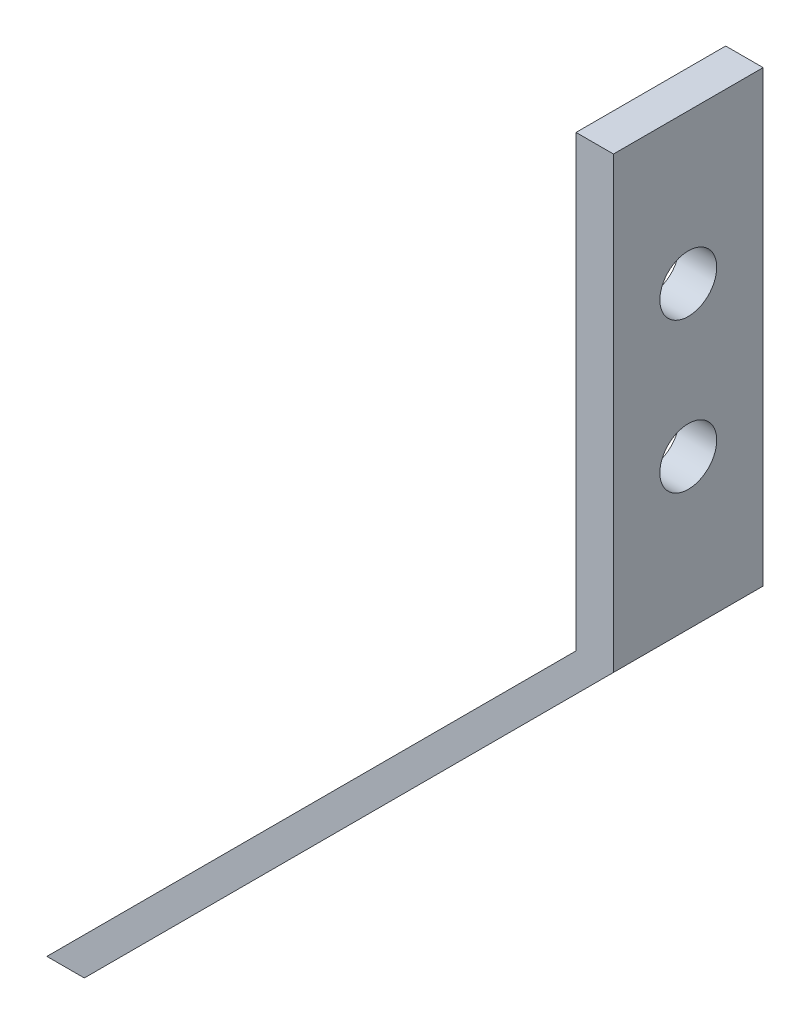
ISO-10303-21;
HEADER;
FILE_DESCRIPTION(('STEP AP214'),'2;1');
FILE_NAME('part.step','',(''),(''),'','','');
FILE_SCHEMA(('AUTOMOTIVE_DESIGN { 1 0 10303 214 1 1 1 1 }'));
ENDSEC;
DATA;
#1=APPLICATION_CONTEXT('core data for automotive mechanical design processes');
#2=APPLICATION_PROTOCOL_DEFINITION('international standard','automotive_design',2000,#1);
#3=PRODUCT_CONTEXT('',#1,'mechanical');
#4=PRODUCT('Part','Part','',(#3));
#5=PRODUCT_RELATED_PRODUCT_CATEGORY('part','',(#4));
#6=PRODUCT_DEFINITION_FORMATION('','',#4);
#7=PRODUCT_DEFINITION_CONTEXT('part definition',#1,'design');
#8=PRODUCT_DEFINITION('design','',#6,#7);
#9=PRODUCT_DEFINITION_SHAPE('','',#8);
#10=(LENGTH_UNIT() NAMED_UNIT(*) SI_UNIT(.MILLI.,.METRE.));
#11=(NAMED_UNIT(*) PLANE_ANGLE_UNIT() SI_UNIT($,.RADIAN.));
#12=(NAMED_UNIT(*) SI_UNIT($,.STERADIAN.) SOLID_ANGLE_UNIT());
#13=UNCERTAINTY_MEASURE_WITH_UNIT(LENGTH_MEASURE(1.E-05),#10,'distance_accuracy_value','');
#14=(GEOMETRIC_REPRESENTATION_CONTEXT(3) GLOBAL_UNCERTAINTY_ASSIGNED_CONTEXT((#13)) GLOBAL_UNIT_ASSIGNED_CONTEXT((#10,
#11,#12)) REPRESENTATION_CONTEXT('',''));
#15=CARTESIAN_POINT('',(0.,0.,0.));
#16=DIRECTION('',(0.,0.,1.));
#17=DIRECTION('',(1.,0.,0.));
#18=AXIS2_PLACEMENT_3D('',#15,#16,#17);
#19=CARTESIAN_POINT('',(-3.175,0.,25.4));
#20=DIRECTION('',(-1.,0.,0.));
#21=DIRECTION('',(0.,0.,1.));
#22=AXIS2_PLACEMENT_3D('',#19,#20,#21);
#23=PLANE('',#22);
#24=CARTESIAN_POINT('',(-3.175,50.8,12.7));
#25=DIRECTION('',(-1.,0.,0.));
#26=DIRECTION('',(0.,0.,1.));
#27=AXIS2_PLACEMENT_3D('',#24,#25,#26);
#28=CIRCLE('',#27,4.826);
#29=CARTESIAN_POINT('',(-3.175,50.8,17.526));
#30=VERTEX_POINT('',#29);
#31=EDGE_CURVE('E158',#30,#30,#28,.T.);
#32=ORIENTED_EDGE('',*,*,#31,.F.);
#33=EDGE_LOOP('',(#32));
#34=FACE_BOUND('',#33,.T.);
#35=CARTESIAN_POINT('',(-3.175,25.4,12.7));
#36=DIRECTION('',(-1.,0.,0.));
#37=DIRECTION('',(0.,0.,1.));
#38=AXIS2_PLACEMENT_3D('',#35,#36,#37);
#39=CIRCLE('',#38,4.826);
#40=CARTESIAN_POINT('',(-3.175,25.4,17.526));
#41=VERTEX_POINT('',#40);
#42=EDGE_CURVE('E165',#41,#41,#39,.T.);
#43=ORIENTED_EDGE('',*,*,#42,.F.);
#44=EDGE_LOOP('',(#43));
#45=FACE_BOUND('',#44,.T.);
#46=DIRECTION('',(0.,1.,0.));
#47=VECTOR('',#46,1.);
#48=CARTESIAN_POINT('',(-3.175,0.,0.));
#49=LINE('',#48,#47);
#50=CARTESIAN_POINT('',(-3.175,0.,0.));
#51=VERTEX_POINT('',#50);
#52=CARTESIAN_POINT('',(-3.175,76.2,0.));
#53=VERTEX_POINT('',#52);
#54=EDGE_CURVE('E128',#51,#53,#49,.T.);
#55=ORIENTED_EDGE('',*,*,#54,.F.);
#56=DIRECTION('',(0.,0.,-1.));
#57=VECTOR('',#56,1.);
#58=CARTESIAN_POINT('',(-3.175,0.,25.4));
#59=LINE('',#58,#57);
#60=CARTESIAN_POINT('',(-3.175,0.,25.4));
#61=VERTEX_POINT('',#60);
#62=EDGE_CURVE('E11',#61,#51,#59,.T.);
#63=ORIENTED_EDGE('',*,*,#62,.F.);
#64=DIRECTION('',(0.,1.,0.));
#65=VECTOR('',#64,1.);
#66=CARTESIAN_POINT('',(-3.175,0.,25.4));
#67=LINE('',#66,#65);
#68=CARTESIAN_POINT('',(-3.175,76.2,25.4));
#69=VERTEX_POINT('',#68);
#70=EDGE_CURVE('E146',#61,#69,#67,.T.);
#71=ORIENTED_EDGE('',*,*,#70,.T.);
#72=DIRECTION('',(0.,0.,-1.));
#73=VECTOR('',#72,1.);
#74=CARTESIAN_POINT('',(-3.175,76.2,25.4));
#75=LINE('',#74,#73);
#76=EDGE_CURVE('E58',#69,#53,#75,.T.);
#77=ORIENTED_EDGE('',*,*,#76,.T.);
#78=EDGE_LOOP('',(#55,#63,#71,#77));
#79=FACE_BOUND('',#78,.T.);
#80=ADVANCED_FACE('F39',(#34,#45,#79),#23,.T.);
#81=CARTESIAN_POINT('',(-1.58750000000002,1.5875,25.4));
#82=DIRECTION('',(0.707106781186552,-0.707106781186543,0.));
#83=DIRECTION('',(0.707106781186543,0.707106781186552,0.));
#84=AXIS2_PLACEMENT_3D('',#81,#82,#83);
#85=PLANE('',#84);
#86=DIRECTION('',(-0.707106781186543,-0.707106781186552,0.));
#87=VECTOR('',#86,1.);
#88=CARTESIAN_POINT('',(-1.58750000000002,1.5875,0.));
#89=LINE('',#88,#87);
#90=CARTESIAN_POINT('',(-92.977561210691,-89.8025612106921,0.));
#91=VERTEX_POINT('',#90);
#92=EDGE_CURVE('E131',#51,#91,#89,.T.);
#93=ORIENTED_EDGE('',*,*,#92,.T.);
#94=DIRECTION('',(0.,0.,-1.));
#95=VECTOR('',#94,1.);
#96=CARTESIAN_POINT('',(-92.977561210691,-89.8025612106921,25.4));
#97=LINE('',#96,#95);
#98=CARTESIAN_POINT('',(-92.977561210691,-89.8025612106921,25.4));
#99=VERTEX_POINT('',#98);
#100=EDGE_CURVE('E49',#99,#91,#97,.T.);
#101=ORIENTED_EDGE('',*,*,#100,.F.);
#102=DIRECTION('',(-0.707106781186543,-0.707106781186552,0.));
#103=VECTOR('',#102,1.);
#104=CARTESIAN_POINT('',(-1.58750000000002,1.5875,25.4));
#105=LINE('',#104,#103);
#106=EDGE_CURVE('E175',#61,#99,#105,.T.);
#107=ORIENTED_EDGE('',*,*,#106,.F.);
#108=ORIENTED_EDGE('',*,*,#62,.T.);
#109=EDGE_LOOP('',(#93,#101,#107,#108));
#110=FACE_BOUND('',#109,.T.);
#111=ADVANCED_FACE('F180',(#110),#85,.F.);
#112=CARTESIAN_POINT('',(1.09906472107864E-11,-89.8025612106807,25.4));
#113=DIRECTION('',(-1.22386790116174E-13,1.,0.));
#114=DIRECTION('',(-1.,-1.22386790116174E-13,0.));
#115=AXIS2_PLACEMENT_3D('',#112,#113,#114);
#116=PLANE('',#115);
#117=DIRECTION('',(1.,1.22386790116174E-13,0.));
#118=VECTOR('',#117,1.);
#119=CARTESIAN_POINT('',(1.09906472107864E-11,-89.8025612106807,0.));
#120=LINE('',#119,#118);
#121=CARTESIAN_POINT('',(-86.6275612106918,-89.8025612106913,0.));
#122=VERTEX_POINT('',#121);
#123=EDGE_CURVE('E134',#91,#122,#120,.T.);
#124=ORIENTED_EDGE('',*,*,#123,.T.);
#125=DIRECTION('',(0.,0.,-1.));
#126=VECTOR('',#125,1.);
#127=CARTESIAN_POINT('',(-86.6275612106918,-89.8025612106913,25.4));
#128=LINE('',#127,#126);
#129=CARTESIAN_POINT('',(-86.6275612106918,-89.8025612106913,25.4));
#130=VERTEX_POINT('',#129);
#131=EDGE_CURVE('E118',#130,#122,#128,.T.);
#132=ORIENTED_EDGE('',*,*,#131,.F.);
#133=DIRECTION('',(1.,1.22386790116174E-13,0.));
#134=VECTOR('',#133,1.);
#135=CARTESIAN_POINT('',(1.09906472107864E-11,-89.8025612106807,25.4));
#136=LINE('',#135,#134);
#137=EDGE_CURVE('E104',#99,#130,#136,.T.);
#138=ORIENTED_EDGE('',*,*,#137,.F.);
#139=ORIENTED_EDGE('',*,*,#100,.T.);
#140=EDGE_LOOP('',(#124,#132,#138,#139));
#141=FACE_BOUND('',#140,.T.);
#142=ADVANCED_FACE('F184',(#141),#116,.F.);
#143=CARTESIAN_POINT('',(1.58749999999999,-1.5875,25.4));
#144=DIRECTION('',(-0.707106781186546,0.707106781186549,0.));
#145=DIRECTION('',(-0.707106781186549,-0.707106781186546,0.));
#146=AXIS2_PLACEMENT_3D('',#143,#144,#145);
#147=PLANE('',#146);
#148=DIRECTION('',(0.707106781186549,0.707106781186546,0.));
#149=VECTOR('',#148,1.);
#150=CARTESIAN_POINT('',(1.58749999999999,-1.5875,0.));
#151=LINE('',#150,#149);
#152=CARTESIAN_POINT('',(3.175,0.,0.));
#153=VERTEX_POINT('',#152);
#154=EDGE_CURVE('E114',#122,#153,#151,.T.);
#155=ORIENTED_EDGE('',*,*,#154,.T.);
#156=DIRECTION('',(0.,0.,-1.));
#157=VECTOR('',#156,1.);
#158=CARTESIAN_POINT('',(3.175,0.,25.4));
#159=LINE('',#158,#157);
#160=CARTESIAN_POINT('',(3.175,0.,25.4));
#161=VERTEX_POINT('',#160);
#162=EDGE_CURVE('E111',#161,#153,#159,.T.);
#163=ORIENTED_EDGE('',*,*,#162,.F.);
#164=DIRECTION('',(0.707106781186549,0.707106781186546,0.));
#165=VECTOR('',#164,1.);
#166=CARTESIAN_POINT('',(1.58749999999999,-1.5875,25.4));
#167=LINE('',#166,#165);
#168=EDGE_CURVE('E96',#130,#161,#167,.T.);
#169=ORIENTED_EDGE('',*,*,#168,.F.);
#170=ORIENTED_EDGE('',*,*,#131,.T.);
#171=EDGE_LOOP('',(#155,#163,#169,#170));
#172=FACE_BOUND('',#171,.T.);
#173=ADVANCED_FACE('F112',(#172),#147,.F.);
#174=CARTESIAN_POINT('',(3.175,0.,25.4));
#175=DIRECTION('',(-1.,0.,0.));
#176=DIRECTION('',(0.,-1.,0.));
#177=AXIS2_PLACEMENT_3D('',#174,#175,#176);
#178=PLANE('',#177);
#179=CARTESIAN_POINT('',(3.17499999999998,50.8,12.7));
#180=DIRECTION('',(-1.,0.,0.));
#181=DIRECTION('',(0.,-1.,0.));
#182=AXIS2_PLACEMENT_3D('',#179,#180,#181);
#183=CIRCLE('',#182,4.826);
#184=CARTESIAN_POINT('',(3.17499999999999,45.974,12.7));
#185=VERTEX_POINT('',#184);
#186=EDGE_CURVE('E42',#185,#185,#183,.T.);
#187=ORIENTED_EDGE('',*,*,#186,.T.);
#188=EDGE_LOOP('',(#187));
#189=FACE_BOUND('',#188,.T.);
#190=CARTESIAN_POINT('',(3.17499999999999,25.4,12.7));
#191=DIRECTION('',(-1.,0.,0.));
#192=DIRECTION('',(0.,-1.,0.));
#193=AXIS2_PLACEMENT_3D('',#190,#191,#192);
#194=CIRCLE('',#193,4.826);
#195=CARTESIAN_POINT('',(3.17499999999999,20.574,12.7));
#196=VERTEX_POINT('',#195);
#197=EDGE_CURVE('E155',#196,#196,#194,.T.);
#198=ORIENTED_EDGE('',*,*,#197,.T.);
#199=EDGE_LOOP('',(#198));
#200=FACE_BOUND('',#199,.T.);
#201=DIRECTION('',(0.,1.,0.));
#202=VECTOR('',#201,1.);
#203=CARTESIAN_POINT('',(3.175,0.,0.));
#204=LINE('',#203,#202);
#205=CARTESIAN_POINT('',(3.17499999999997,76.2,0.));
#206=VERTEX_POINT('',#205);
#207=EDGE_CURVE('E139',#153,#206,#204,.T.);
#208=ORIENTED_EDGE('',*,*,#207,.T.);
#209=DIRECTION('',(0.,0.,-1.));
#210=VECTOR('',#209,1.);
#211=CARTESIAN_POINT('',(3.17499999999997,76.2,25.4));
#212=LINE('',#211,#210);
#213=CARTESIAN_POINT('',(3.17499999999997,76.2,25.4));
#214=VERTEX_POINT('',#213);
#215=EDGE_CURVE('E78',#214,#206,#212,.T.);
#216=ORIENTED_EDGE('',*,*,#215,.F.);
#217=DIRECTION('',(0.,1.,0.));
#218=VECTOR('',#217,1.);
#219=CARTESIAN_POINT('',(3.175,0.,25.4));
#220=LINE('',#219,#218);
#221=EDGE_CURVE('E102',#161,#214,#220,.T.);
#222=ORIENTED_EDGE('',*,*,#221,.F.);
#223=ORIENTED_EDGE('',*,*,#162,.T.);
#224=EDGE_LOOP('',(#208,#216,#222,#223));
#225=FACE_BOUND('',#224,.T.);
#226=ADVANCED_FACE('F120',(#189,#200,#225),#178,.F.);
#227=CARTESIAN_POINT('',(0.,76.2,25.4));
#228=DIRECTION('',(0.,1.,0.));
#229=DIRECTION('',(0.,0.,1.));
#230=AXIS2_PLACEMENT_3D('',#227,#228,#229);
#231=PLANE('',#230);
#232=DIRECTION('',(1.,0.,0.));
#233=VECTOR('',#232,1.);
#234=CARTESIAN_POINT('',(0.,76.2,0.));
#235=LINE('',#234,#233);
#236=EDGE_CURVE('E142',#53,#206,#235,.T.);
#237=ORIENTED_EDGE('',*,*,#236,.F.);
#238=ORIENTED_EDGE('',*,*,#76,.F.);
#239=DIRECTION('',(1.,0.,0.));
#240=VECTOR('',#239,1.);
#241=CARTESIAN_POINT('',(0.,76.2,25.4));
#242=LINE('',#241,#240);
#243=EDGE_CURVE('E122',#69,#214,#242,.T.);
#244=ORIENTED_EDGE('',*,*,#243,.T.);
#245=ORIENTED_EDGE('',*,*,#215,.T.);
#246=EDGE_LOOP('',(#237,#238,#244,#245));
#247=FACE_BOUND('',#246,.T.);
#248=ADVANCED_FACE('F187',(#247),#231,.T.);
#249=CARTESIAN_POINT('',(0.,0.,25.4));
#250=DIRECTION('',(0.,0.,1.));
#251=DIRECTION('',(1.,0.,0.));
#252=AXIS2_PLACEMENT_3D('',#249,#250,#251);
#253=PLANE('',#252);
#254=ORIENTED_EDGE('',*,*,#70,.F.);
#255=ORIENTED_EDGE('',*,*,#106,.T.);
#256=ORIENTED_EDGE('',*,*,#137,.T.);
#257=ORIENTED_EDGE('',*,*,#168,.T.);
#258=ORIENTED_EDGE('',*,*,#221,.T.);
#259=ORIENTED_EDGE('',*,*,#243,.F.);
#260=EDGE_LOOP('',(#254,#255,#256,#257,#258,#259));
#261=FACE_BOUND('',#260,.T.);
#262=ADVANCED_FACE('F99',(#261),#253,.T.);
#263=CARTESIAN_POINT('',(0.,0.,0.));
#264=DIRECTION('',(0.,0.,1.));
#265=DIRECTION('',(1.,0.,0.));
#266=AXIS2_PLACEMENT_3D('',#263,#264,#265);
#267=PLANE('',#266);
#268=ORIENTED_EDGE('',*,*,#54,.T.);
#269=ORIENTED_EDGE('',*,*,#236,.T.);
#270=ORIENTED_EDGE('',*,*,#207,.F.);
#271=ORIENTED_EDGE('',*,*,#154,.F.);
#272=ORIENTED_EDGE('',*,*,#123,.F.);
#273=ORIENTED_EDGE('',*,*,#92,.F.);
#274=EDGE_LOOP('',(#268,#269,#270,#271,#272,#273));
#275=FACE_BOUND('',#274,.T.);
#276=ADVANCED_FACE('F186',(#275),#267,.F.);
#277=CARTESIAN_POINT('',(22.225,25.4,12.7));
#278=DIRECTION('',(-1.,0.,0.));
#279=DIRECTION('',(0.,0.,1.));
#280=AXIS2_PLACEMENT_3D('',#277,#278,#279);
#281=CYLINDRICAL_SURFACE('',#280,4.826);
#282=ORIENTED_EDGE('',*,*,#42,.T.);
#283=EDGE_LOOP('',(#282));
#284=FACE_BOUND('',#283,.T.);
#285=ORIENTED_EDGE('',*,*,#197,.F.);
#286=EDGE_LOOP('',(#285));
#287=FACE_BOUND('',#286,.T.);
#288=ADVANCED_FACE('F206',(#284,#287),#281,.F.);
#289=CARTESIAN_POINT('',(22.225,50.8,12.7));
#290=DIRECTION('',(-1.,0.,0.));
#291=DIRECTION('',(0.,0.,1.));
#292=AXIS2_PLACEMENT_3D('',#289,#290,#291);
#293=CYLINDRICAL_SURFACE('',#292,4.826);
#294=ORIENTED_EDGE('',*,*,#31,.T.);
#295=EDGE_LOOP('',(#294));
#296=FACE_BOUND('',#295,.T.);
#297=ORIENTED_EDGE('',*,*,#186,.F.);
#298=EDGE_LOOP('',(#297));
#299=FACE_BOUND('',#298,.T.);
#300=ADVANCED_FACE('F209',(#296,#299),#293,.F.);
#301=CLOSED_SHELL('',(#80,#111,#142,#173,#226,#248,#262,#276,#288,#300));
#302=MANIFOLD_SOLID_BREP('B2',#301);
#303=ADVANCED_BREP_SHAPE_REPRESENTATION('',(#18,#302),#14);
#304=SHAPE_DEFINITION_REPRESENTATION(#9,#303);
ENDSEC;
END-ISO-10303-21;
